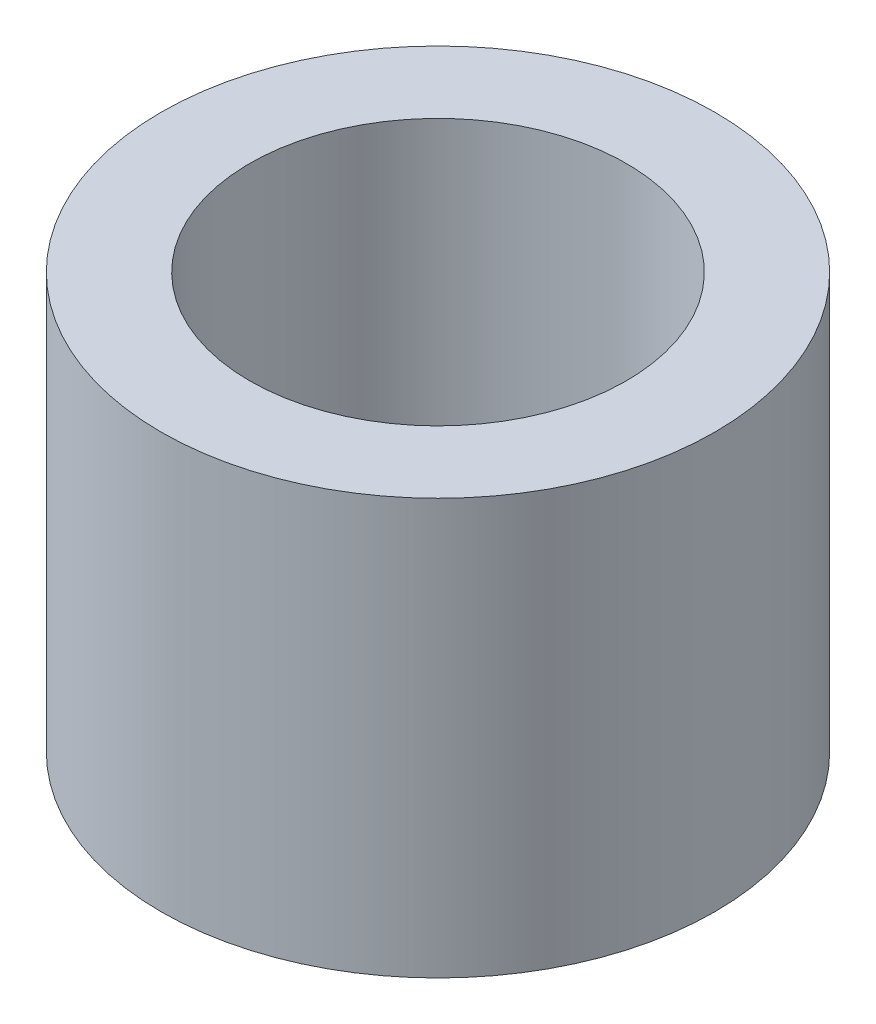
ISO-10303-21;
HEADER;
FILE_DESCRIPTION(('STEP AP214'),'2;1');
FILE_NAME('part.step','',(''),(''),'','','');
FILE_SCHEMA(('AUTOMOTIVE_DESIGN { 1 0 10303 214 1 1 1 1 }'));
ENDSEC;
DATA;
#1=APPLICATION_CONTEXT('core data for automotive mechanical design processes');
#2=APPLICATION_PROTOCOL_DEFINITION('international standard','automotive_design',2000,#1);
#3=PRODUCT_CONTEXT('',#1,'mechanical');
#4=PRODUCT('Part','Part','',(#3));
#5=PRODUCT_RELATED_PRODUCT_CATEGORY('part','',(#4));
#6=PRODUCT_DEFINITION_FORMATION('','',#4);
#7=PRODUCT_DEFINITION_CONTEXT('part definition',#1,'design');
#8=PRODUCT_DEFINITION('design','',#6,#7);
#9=PRODUCT_DEFINITION_SHAPE('','',#8);
#10=(LENGTH_UNIT() NAMED_UNIT(*) SI_UNIT(.MILLI.,.METRE.));
#11=(NAMED_UNIT(*) PLANE_ANGLE_UNIT() SI_UNIT($,.RADIAN.));
#12=(NAMED_UNIT(*) SI_UNIT($,.STERADIAN.) SOLID_ANGLE_UNIT());
#13=UNCERTAINTY_MEASURE_WITH_UNIT(LENGTH_MEASURE(1.E-05),#10,'distance_accuracy_value','');
#14=(GEOMETRIC_REPRESENTATION_CONTEXT(3) GLOBAL_UNCERTAINTY_ASSIGNED_CONTEXT((#13)) GLOBAL_UNIT_ASSIGNED_CONTEXT((#10,
#11,#12)) REPRESENTATION_CONTEXT('',''));
#15=CARTESIAN_POINT('',(0.,0.,0.));
#16=DIRECTION('',(0.,0.,1.));
#17=DIRECTION('',(1.,0.,0.));
#18=AXIS2_PLACEMENT_3D('',#15,#16,#17);
#19=CARTESIAN_POINT('',(0.,4.7625,0.));
#20=DIRECTION('',(0.,1.,0.));
#21=DIRECTION('',(0.,0.,1.));
#22=AXIS2_PLACEMENT_3D('',#19,#20,#21);
#23=PLANE('',#22);
#24=CARTESIAN_POINT('',(0.,4.7625,0.));
#25=DIRECTION('',(0.,1.,0.));
#26=DIRECTION('',(0.,0.,1.));
#27=AXIS2_PLACEMENT_3D('',#24,#25,#26);
#28=CIRCLE('',#27,3.175);
#29=CARTESIAN_POINT('',(0.,4.7625,3.175));
#30=VERTEX_POINT('',#29);
#31=EDGE_CURVE('E10',#30,#30,#28,.T.);
#32=ORIENTED_EDGE('',*,*,#31,.T.);
#33=EDGE_LOOP('',(#32));
#34=FACE_BOUND('',#33,.T.);
#35=CARTESIAN_POINT('',(0.,4.7625,0.));
#36=DIRECTION('',(0.,1.,0.));
#37=DIRECTION('',(0.,0.,1.));
#38=AXIS2_PLACEMENT_3D('',#35,#36,#37);
#39=CIRCLE('',#38,2.159);
#40=CARTESIAN_POINT('',(0.,4.7625,2.159));
#41=VERTEX_POINT('',#40);
#42=EDGE_CURVE('E42',#41,#41,#39,.T.);
#43=ORIENTED_EDGE('',*,*,#42,.F.);
#44=EDGE_LOOP('',(#43));
#45=FACE_BOUND('',#44,.T.);
#46=ADVANCED_FACE('F31',(#34,#45),#23,.T.);
#47=CARTESIAN_POINT('',(0.,0.,0.));
#48=DIRECTION('',(0.,1.,0.));
#49=DIRECTION('',(0.,0.,1.));
#50=AXIS2_PLACEMENT_3D('',#47,#48,#49);
#51=PLANE('',#50);
#52=CARTESIAN_POINT('',(0.,0.,0.));
#53=DIRECTION('',(0.,1.,0.));
#54=DIRECTION('',(0.,0.,1.));
#55=AXIS2_PLACEMENT_3D('',#52,#53,#54);
#56=CIRCLE('',#55,3.175);
#57=CARTESIAN_POINT('',(0.,0.,3.175));
#58=VERTEX_POINT('',#57);
#59=EDGE_CURVE('E35',#58,#58,#56,.T.);
#60=ORIENTED_EDGE('',*,*,#59,.F.);
#61=EDGE_LOOP('',(#60));
#62=FACE_BOUND('',#61,.T.);
#63=CARTESIAN_POINT('',(0.,0.,0.));
#64=DIRECTION('',(0.,1.,0.));
#65=DIRECTION('',(0.,0.,1.));
#66=AXIS2_PLACEMENT_3D('',#63,#64,#65);
#67=CIRCLE('',#66,2.159);
#68=CARTESIAN_POINT('',(0.,0.,2.159));
#69=VERTEX_POINT('',#68);
#70=EDGE_CURVE('E44',#69,#69,#67,.T.);
#71=ORIENTED_EDGE('',*,*,#70,.T.);
#72=EDGE_LOOP('',(#71));
#73=FACE_BOUND('',#72,.T.);
#74=ADVANCED_FACE('F54',(#62,#73),#51,.F.);
#75=CARTESIAN_POINT('',(0.,4.7625,0.));
#76=DIRECTION('',(0.,-1.,0.));
#77=DIRECTION('',(0.,0.,-1.));
#78=AXIS2_PLACEMENT_3D('',#75,#76,#77);
#79=CYLINDRICAL_SURFACE('',#78,3.175);
#80=ORIENTED_EDGE('',*,*,#31,.F.);
#81=EDGE_LOOP('',(#80));
#82=FACE_BOUND('',#81,.T.);
#83=ORIENTED_EDGE('',*,*,#59,.T.);
#84=EDGE_LOOP('',(#83));
#85=FACE_BOUND('',#84,.T.);
#86=ADVANCED_FACE('F33',(#82,#85),#79,.T.);
#87=CARTESIAN_POINT('',(0.,4.7625,0.));
#88=DIRECTION('',(0.,-1.,0.));
#89=DIRECTION('',(0.,0.,-1.));
#90=AXIS2_PLACEMENT_3D('',#87,#88,#89);
#91=CYLINDRICAL_SURFACE('',#90,2.159);
#92=ORIENTED_EDGE('',*,*,#42,.T.);
#93=EDGE_LOOP('',(#92));
#94=FACE_BOUND('',#93,.T.);
#95=ORIENTED_EDGE('',*,*,#70,.F.);
#96=EDGE_LOOP('',(#95));
#97=FACE_BOUND('',#96,.T.);
#98=ADVANCED_FACE('F50',(#94,#97),#91,.F.);
#99=CLOSED_SHELL('',(#46,#74,#86,#98));
#100=MANIFOLD_SOLID_BREP('B2',#99);
#101=ADVANCED_BREP_SHAPE_REPRESENTATION('',(#18,#100),#14);
#102=SHAPE_DEFINITION_REPRESENTATION(#9,#101);
ENDSEC;
END-ISO-10303-21;
